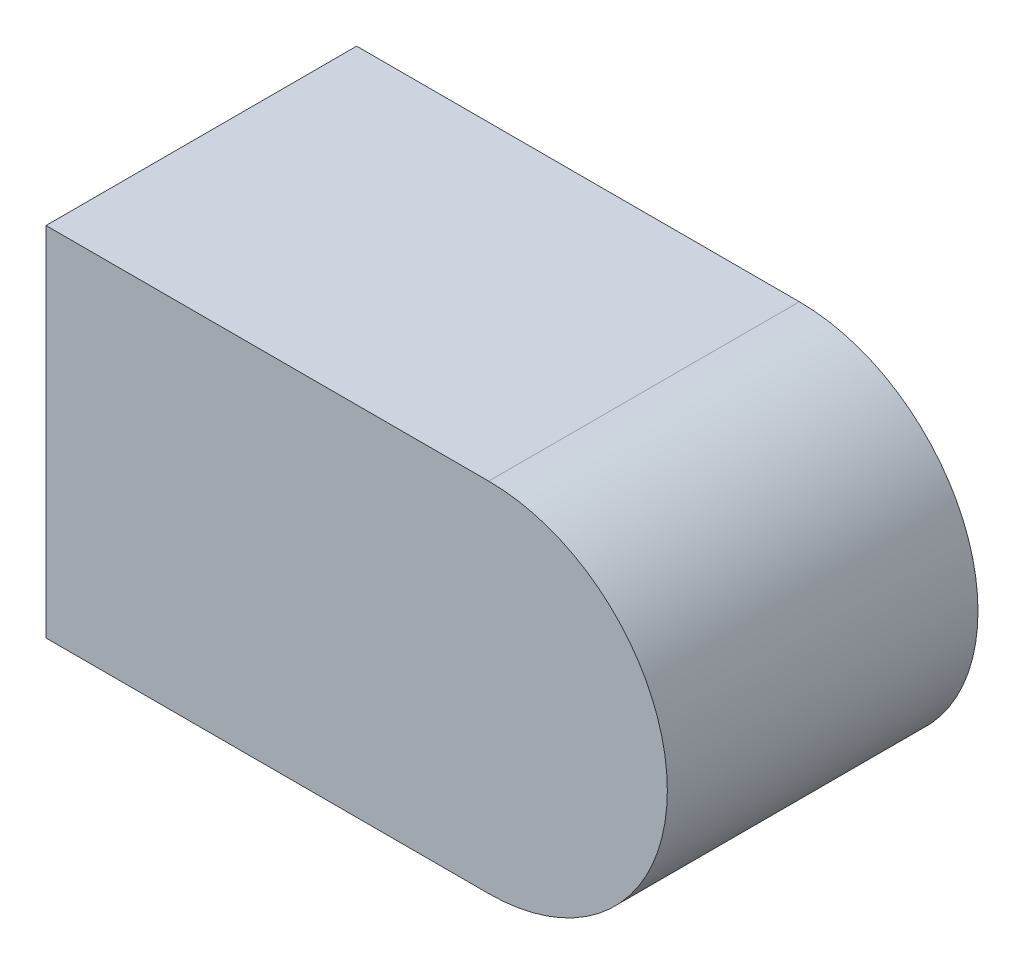
ISO-10303-21;
HEADER;
FILE_DESCRIPTION(('STEP AP214'),'2;1');
FILE_NAME('part.step','',(''),(''),'','','');
FILE_SCHEMA(('AUTOMOTIVE_DESIGN { 1 0 10303 214 1 1 1 1 }'));
ENDSEC;
DATA;
#1=APPLICATION_CONTEXT('core data for automotive mechanical design processes');
#2=APPLICATION_PROTOCOL_DEFINITION('international standard','automotive_design',2000,#1);
#3=PRODUCT_CONTEXT('',#1,'mechanical');
#4=PRODUCT('Part','Part','',(#3));
#5=PRODUCT_RELATED_PRODUCT_CATEGORY('part','',(#4));
#6=PRODUCT_DEFINITION_FORMATION('','',#4);
#7=PRODUCT_DEFINITION_CONTEXT('part definition',#1,'design');
#8=PRODUCT_DEFINITION('design','',#6,#7);
#9=PRODUCT_DEFINITION_SHAPE('','',#8);
#10=(LENGTH_UNIT() NAMED_UNIT(*) SI_UNIT(.MILLI.,.METRE.));
#11=(NAMED_UNIT(*) PLANE_ANGLE_UNIT() SI_UNIT($,.RADIAN.));
#12=(NAMED_UNIT(*) SI_UNIT($,.STERADIAN.) SOLID_ANGLE_UNIT());
#13=UNCERTAINTY_MEASURE_WITH_UNIT(LENGTH_MEASURE(1.E-05),#10,'distance_accuracy_value','');
#14=(GEOMETRIC_REPRESENTATION_CONTEXT(3) GLOBAL_UNCERTAINTY_ASSIGNED_CONTEXT((#13)) GLOBAL_UNIT_ASSIGNED_CONTEXT((#10,
#11,#12)) REPRESENTATION_CONTEXT('',''));
#15=CARTESIAN_POINT('',(0.,0.,0.));
#16=DIRECTION('',(0.,0.,1.));
#17=DIRECTION('',(1.,0.,0.));
#18=AXIS2_PLACEMENT_3D('',#15,#16,#17);
#19=CARTESIAN_POINT('',(-2.8335265642716,-0.25,0.));
#20=DIRECTION('',(0.,0.,1.));
#21=DIRECTION('',(1.,0.,0.));
#22=AXIS2_PLACEMENT_3D('',#19,#20,#21);
#23=PLANE('',#22);
#24=DIRECTION('',(0.,-1.,0.));
#25=VECTOR('',#24,1.);
#26=CARTESIAN_POINT('',(-3.,-0.135,0.));
#27=LINE('',#26,#25);
#28=CARTESIAN_POINT('',(-3.,-0.135,0.));
#29=VERTEX_POINT('',#28);
#30=CARTESIAN_POINT('',(-3.,-0.365,0.));
#31=VERTEX_POINT('',#30);
#32=EDGE_CURVE('E11',#29,#31,#27,.T.);
#33=ORIENTED_EDGE('',*,*,#32,.F.);
#34=DIRECTION('',(-1.,0.,0.));
#35=VECTOR('',#34,1.);
#36=CARTESIAN_POINT('',(-2.715,-0.135,0.));
#37=LINE('',#36,#35);
#38=CARTESIAN_POINT('',(-2.715,-0.135,0.));
#39=VERTEX_POINT('',#38);
#40=EDGE_CURVE('E24',#39,#29,#37,.T.);
#41=ORIENTED_EDGE('',*,*,#40,.F.);
#42=CARTESIAN_POINT('',(-2.715,-0.25,0.));
#43=DIRECTION('',(0.,0.,1.));
#44=DIRECTION('',(0.,-1.,0.));
#45=AXIS2_PLACEMENT_3D('',#42,#43,#44);
#46=CIRCLE('',#45,0.115);
#47=CARTESIAN_POINT('',(-2.715,-0.364999999999999,0.));
#48=VERTEX_POINT('',#47);
#49=EDGE_CURVE('E85',#48,#39,#46,.T.);
#50=ORIENTED_EDGE('',*,*,#49,.F.);
#51=DIRECTION('',(1.,0.,0.));
#52=VECTOR('',#51,1.);
#53=CARTESIAN_POINT('',(-3.,-0.365,0.));
#54=LINE('',#53,#52);
#55=EDGE_CURVE('E82',#31,#48,#54,.T.);
#56=ORIENTED_EDGE('',*,*,#55,.F.);
#57=EDGE_LOOP('',(#33,#41,#50,#56));
#58=FACE_BOUND('',#57,.T.);
#59=ADVANCED_FACE('F17',(#58),#23,.F.);
#60=CARTESIAN_POINT('',(-3.,-0.365,0.));
#61=DIRECTION('',(0.,-1.,0.));
#62=DIRECTION('',(1.,0.,0.));
#63=AXIS2_PLACEMENT_3D('',#60,#61,#62);
#64=PLANE('',#63);
#65=ORIENTED_EDGE('',*,*,#55,.T.);
#66=DIRECTION('',(0.,0.,1.));
#67=VECTOR('',#66,1.);
#68=CARTESIAN_POINT('',(-2.715,-0.364999999999999,0.));
#69=LINE('',#68,#67);
#70=CARTESIAN_POINT('',(-2.715,-0.364999999999999,0.2));
#71=VERTEX_POINT('',#70);
#72=EDGE_CURVE('E80',#48,#71,#69,.T.);
#73=ORIENTED_EDGE('',*,*,#72,.T.);
#74=DIRECTION('',(1.,0.,0.));
#75=VECTOR('',#74,1.);
#76=CARTESIAN_POINT('',(-3.,-0.365,0.2));
#77=LINE('',#76,#75);
#78=CARTESIAN_POINT('',(-3.,-0.365,0.2));
#79=VERTEX_POINT('',#78);
#80=EDGE_CURVE('E78',#79,#71,#77,.T.);
#81=ORIENTED_EDGE('',*,*,#80,.F.);
#82=DIRECTION('',(0.,0.,-1.));
#83=VECTOR('',#82,1.);
#84=CARTESIAN_POINT('',(-3.,-0.365,0.));
#85=LINE('',#84,#83);
#86=EDGE_CURVE('E71',#79,#31,#85,.T.);
#87=ORIENTED_EDGE('',*,*,#86,.T.);
#88=EDGE_LOOP('',(#65,#73,#81,#87));
#89=FACE_BOUND('',#88,.T.);
#90=ADVANCED_FACE('F91',(#89),#64,.T.);
#91=CARTESIAN_POINT('',(-2.715,-0.25,0.));
#92=DIRECTION('',(0.,0.,1.));
#93=DIRECTION('',(0.,-1.,0.));
#94=AXIS2_PLACEMENT_3D('',#91,#92,#93);
#95=CYLINDRICAL_SURFACE('',#94,0.115);
#96=ORIENTED_EDGE('',*,*,#49,.T.);
#97=DIRECTION('',(0.,0.,1.));
#98=VECTOR('',#97,1.);
#99=CARTESIAN_POINT('',(-2.715,-0.135,0.));
#100=LINE('',#99,#98);
#101=CARTESIAN_POINT('',(-2.715,-0.135,0.2));
#102=VERTEX_POINT('',#101);
#103=EDGE_CURVE('E75',#39,#102,#100,.T.);
#104=ORIENTED_EDGE('',*,*,#103,.T.);
#105=CARTESIAN_POINT('',(-2.715,-0.25,0.2));
#106=DIRECTION('',(0.,0.,1.));
#107=DIRECTION('',(0.,-1.,0.));
#108=AXIS2_PLACEMENT_3D('',#105,#106,#107);
#109=CIRCLE('',#108,0.115);
#110=EDGE_CURVE('E59',#71,#102,#109,.T.);
#111=ORIENTED_EDGE('',*,*,#110,.F.);
#112=ORIENTED_EDGE('',*,*,#72,.F.);
#113=EDGE_LOOP('',(#96,#104,#111,#112));
#114=FACE_BOUND('',#113,.T.);
#115=ADVANCED_FACE('F89',(#114),#95,.T.);
#116=CARTESIAN_POINT('',(-2.715,-0.135,0.));
#117=DIRECTION('',(0.,1.,0.));
#118=DIRECTION('',(-1.,0.,0.));
#119=AXIS2_PLACEMENT_3D('',#116,#117,#118);
#120=PLANE('',#119);
#121=ORIENTED_EDGE('',*,*,#40,.T.);
#122=DIRECTION('',(0.,0.,1.));
#123=VECTOR('',#122,1.);
#124=CARTESIAN_POINT('',(-3.,-0.135,0.));
#125=LINE('',#124,#123);
#126=CARTESIAN_POINT('',(-3.,-0.135,0.2));
#127=VERTEX_POINT('',#126);
#128=EDGE_CURVE('E53',#29,#127,#125,.T.);
#129=ORIENTED_EDGE('',*,*,#128,.T.);
#130=DIRECTION('',(-1.,0.,0.));
#131=VECTOR('',#130,1.);
#132=CARTESIAN_POINT('',(-2.715,-0.135,0.2));
#133=LINE('',#132,#131);
#134=EDGE_CURVE('E57',#102,#127,#133,.T.);
#135=ORIENTED_EDGE('',*,*,#134,.F.);
#136=ORIENTED_EDGE('',*,*,#103,.F.);
#137=EDGE_LOOP('',(#121,#129,#135,#136));
#138=FACE_BOUND('',#137,.T.);
#139=ADVANCED_FACE('F55',(#138),#120,.T.);
#140=CARTESIAN_POINT('',(-3.,3.,0.));
#141=DIRECTION('',(-1.,0.,0.));
#142=DIRECTION('',(0.,-1.,0.));
#143=AXIS2_PLACEMENT_3D('',#140,#141,#142);
#144=PLANE('',#143);
#145=ORIENTED_EDGE('',*,*,#86,.F.);
#146=DIRECTION('',(0.,-1.,0.));
#147=VECTOR('',#146,1.);
#148=CARTESIAN_POINT('',(-3.,1.375,0.2));
#149=LINE('',#148,#147);
#150=EDGE_CURVE('E66',#127,#79,#149,.T.);
#151=ORIENTED_EDGE('',*,*,#150,.F.);
#152=ORIENTED_EDGE('',*,*,#128,.F.);
#153=ORIENTED_EDGE('',*,*,#32,.T.);
#154=EDGE_LOOP('',(#145,#151,#152,#153));
#155=FACE_BOUND('',#154,.T.);
#156=ADVANCED_FACE('F69',(#155),#144,.T.);
#157=CARTESIAN_POINT('',(-2.8335240809167,-0.25,0.2));
#158=DIRECTION('',(0.,0.,1.));
#159=DIRECTION('',(1.,0.,0.));
#160=AXIS2_PLACEMENT_3D('',#157,#158,#159);
#161=PLANE('',#160);
#162=ORIENTED_EDGE('',*,*,#134,.T.);
#163=ORIENTED_EDGE('',*,*,#150,.T.);
#164=ORIENTED_EDGE('',*,*,#80,.T.);
#165=ORIENTED_EDGE('',*,*,#110,.T.);
#166=EDGE_LOOP('',(#162,#163,#164,#165));
#167=FACE_BOUND('',#166,.T.);
#168=ADVANCED_FACE('F64',(#167),#161,.T.);
#169=CLOSED_SHELL('',(#59,#90,#115,#139,#156,#168));
#170=MANIFOLD_SOLID_BREP('B1',#169);
#171=ADVANCED_BREP_SHAPE_REPRESENTATION('',(#18,#170),#14);
#172=SHAPE_DEFINITION_REPRESENTATION(#9,#171);
ENDSEC;
END-ISO-10303-21;
